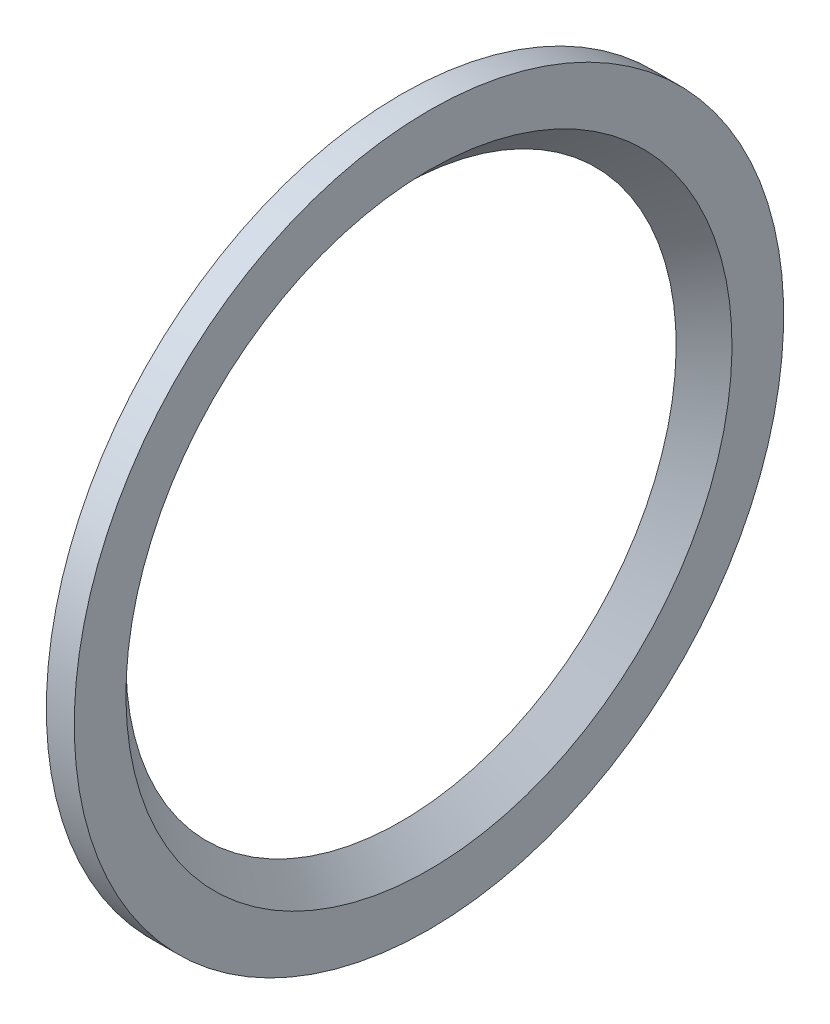
ISO-10303-21;
HEADER;
FILE_DESCRIPTION(('STEP AP214'),'2;1');
FILE_NAME('part.step','',(''),(''),'','','');
FILE_SCHEMA(('AUTOMOTIVE_DESIGN { 1 0 10303 214 1 1 1 1 }'));
ENDSEC;
DATA;
#1=APPLICATION_CONTEXT('core data for automotive mechanical design processes');
#2=APPLICATION_PROTOCOL_DEFINITION('international standard','automotive_design',2000,#1);
#3=PRODUCT_CONTEXT('',#1,'mechanical');
#4=PRODUCT('Part','Part','',(#3));
#5=PRODUCT_RELATED_PRODUCT_CATEGORY('part','',(#4));
#6=PRODUCT_DEFINITION_FORMATION('','',#4);
#7=PRODUCT_DEFINITION_CONTEXT('part definition',#1,'design');
#8=PRODUCT_DEFINITION('design','',#6,#7);
#9=PRODUCT_DEFINITION_SHAPE('','',#8);
#10=(LENGTH_UNIT() NAMED_UNIT(*) SI_UNIT(.MILLI.,.METRE.));
#11=(NAMED_UNIT(*) PLANE_ANGLE_UNIT() SI_UNIT($,.RADIAN.));
#12=(NAMED_UNIT(*) SI_UNIT($,.STERADIAN.) SOLID_ANGLE_UNIT());
#13=UNCERTAINTY_MEASURE_WITH_UNIT(LENGTH_MEASURE(1.E-05),#10,'distance_accuracy_value','');
#14=(GEOMETRIC_REPRESENTATION_CONTEXT(3) GLOBAL_UNCERTAINTY_ASSIGNED_CONTEXT((#13)) GLOBAL_UNIT_ASSIGNED_CONTEXT((#10,
#11,#12)) REPRESENTATION_CONTEXT('',''));
#15=CARTESIAN_POINT('',(0.,0.,0.));
#16=DIRECTION('',(0.,0.,1.));
#17=DIRECTION('',(1.,0.,0.));
#18=AXIS2_PLACEMENT_3D('',#15,#16,#17);
#19=CARTESIAN_POINT('',(-215.05,0.,0.));
#20=DIRECTION('',(1.,0.,0.));
#21=DIRECTION('',(0.,1.,0.));
#22=AXIS2_PLACEMENT_3D('',#19,#20,#21);
#23=CONICAL_SURFACE('',#22,21.7000000000002,0.785398163397445);
#24=CARTESIAN_POINT('',(-217.05,0.,0.));
#25=DIRECTION('',(1.,0.,0.));
#26=DIRECTION('',(0.,1.,0.));
#27=AXIS2_PLACEMENT_3D('',#24,#25,#26);
#28=CIRCLE('',#27,19.7000000000002);
#29=CARTESIAN_POINT('',(-217.05,19.7000000000002,0.));
#30=VERTEX_POINT('',#29);
#31=EDGE_CURVE('E10',#30,#30,#28,.T.);
#32=ORIENTED_EDGE('',*,*,#31,.F.);
#33=EDGE_LOOP('',(#32));
#34=FACE_BOUND('',#33,.T.);
#35=CARTESIAN_POINT('',(-215.05,0.,0.));
#36=DIRECTION('',(1.,0.,0.));
#37=DIRECTION('',(0.,1.,0.));
#38=AXIS2_PLACEMENT_3D('',#35,#36,#37);
#39=CIRCLE('',#38,21.7000000000002);
#40=CARTESIAN_POINT('',(-215.05,21.7000000000002,0.));
#41=VERTEX_POINT('',#40);
#42=EDGE_CURVE('E48',#41,#41,#39,.T.);
#43=ORIENTED_EDGE('',*,*,#42,.T.);
#44=EDGE_LOOP('',(#43));
#45=FACE_BOUND('',#44,.T.);
#46=ADVANCED_FACE('F34',(#34,#45),#23,.F.);
#47=CARTESIAN_POINT('',(-217.05,-19.7000000000001,0.));
#48=DIRECTION('',(1.,0.,0.));
#49=DIRECTION('',(0.,1.,0.));
#50=AXIS2_PLACEMENT_3D('',#47,#48,#49);
#51=PLANE('',#50);
#52=CARTESIAN_POINT('',(-217.05,0.,0.));
#53=DIRECTION('',(1.,0.,0.));
#54=DIRECTION('',(0.,1.,0.));
#55=AXIS2_PLACEMENT_3D('',#52,#53,#54);
#56=CIRCLE('',#55,25.4000000000002);
#57=CARTESIAN_POINT('',(-217.05,25.4000000000002,0.));
#58=VERTEX_POINT('',#57);
#59=EDGE_CURVE('E40',#58,#58,#56,.T.);
#60=ORIENTED_EDGE('',*,*,#59,.F.);
#61=EDGE_LOOP('',(#60));
#62=FACE_BOUND('',#61,.T.);
#63=ORIENTED_EDGE('',*,*,#31,.T.);
#64=EDGE_LOOP('',(#63));
#65=FACE_BOUND('',#64,.T.);
#66=ADVANCED_FACE('F63',(#62,#65),#51,.F.);
#67=CARTESIAN_POINT('',(-67.4822610575465,0.,0.));
#68=DIRECTION('',(1.,0.,0.));
#69=DIRECTION('',(0.,1.,0.));
#70=AXIS2_PLACEMENT_3D('',#67,#68,#69);
#71=CYLINDRICAL_SURFACE('',#70,25.4000000000002);
#72=CARTESIAN_POINT('',(-215.05,0.,0.));
#73=DIRECTION('',(1.,0.,0.));
#74=DIRECTION('',(0.,1.,0.));
#75=AXIS2_PLACEMENT_3D('',#72,#73,#74);
#76=CIRCLE('',#75,25.4000000000002);
#77=CARTESIAN_POINT('',(-215.05,25.4000000000002,0.));
#78=VERTEX_POINT('',#77);
#79=EDGE_CURVE('E44',#78,#78,#76,.T.);
#80=ORIENTED_EDGE('',*,*,#79,.F.);
#81=EDGE_LOOP('',(#80));
#82=FACE_BOUND('',#81,.T.);
#83=ORIENTED_EDGE('',*,*,#59,.T.);
#84=EDGE_LOOP('',(#83));
#85=FACE_BOUND('',#84,.T.);
#86=ADVANCED_FACE('F58',(#82,#85),#71,.T.);
#87=CARTESIAN_POINT('',(-215.05,-25.4000000000001,0.));
#88=DIRECTION('',(-1.,0.,0.));
#89=DIRECTION('',(0.,-1.,0.));
#90=AXIS2_PLACEMENT_3D('',#87,#88,#89);
#91=PLANE('',#90);
#92=ORIENTED_EDGE('',*,*,#42,.F.);
#93=EDGE_LOOP('',(#92));
#94=FACE_BOUND('',#93,.T.);
#95=ORIENTED_EDGE('',*,*,#79,.T.);
#96=EDGE_LOOP('',(#95));
#97=FACE_BOUND('',#96,.T.);
#98=ADVANCED_FACE('F55',(#94,#97),#91,.F.);
#99=CLOSED_SHELL('',(#46,#66,#86,#98));
#100=MANIFOLD_SOLID_BREP('B2',#99);
#101=ADVANCED_BREP_SHAPE_REPRESENTATION('',(#18,#100),#14);
#102=SHAPE_DEFINITION_REPRESENTATION(#9,#101);
ENDSEC;
END-ISO-10303-21;
